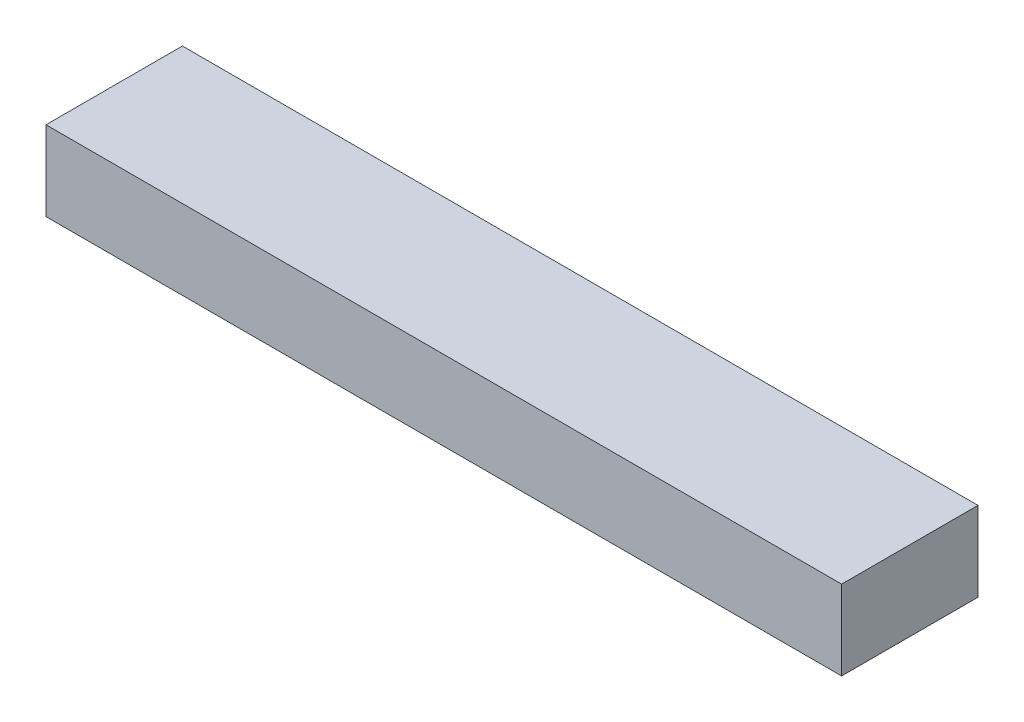
ISO-10303-21;
HEADER;
FILE_DESCRIPTION(('STEP AP214'),'2;1');
FILE_NAME('part.step','',(''),(''),'','','');
FILE_SCHEMA(('AUTOMOTIVE_DESIGN { 1 0 10303 214 1 1 1 1 }'));
ENDSEC;
DATA;
#1=APPLICATION_CONTEXT('core data for automotive mechanical design processes');
#2=APPLICATION_PROTOCOL_DEFINITION('international standard','automotive_design',2000,#1);
#3=PRODUCT_CONTEXT('',#1,'mechanical');
#4=PRODUCT('Part','Part','',(#3));
#5=PRODUCT_RELATED_PRODUCT_CATEGORY('part','',(#4));
#6=PRODUCT_DEFINITION_FORMATION('','',#4);
#7=PRODUCT_DEFINITION_CONTEXT('part definition',#1,'design');
#8=PRODUCT_DEFINITION('design','',#6,#7);
#9=PRODUCT_DEFINITION_SHAPE('','',#8);
#10=(LENGTH_UNIT() NAMED_UNIT(*) SI_UNIT(.MILLI.,.METRE.));
#11=(NAMED_UNIT(*) PLANE_ANGLE_UNIT() SI_UNIT($,.RADIAN.));
#12=(NAMED_UNIT(*) SI_UNIT($,.STERADIAN.) SOLID_ANGLE_UNIT());
#13=UNCERTAINTY_MEASURE_WITH_UNIT(LENGTH_MEASURE(1.E-05),#10,'distance_accuracy_value','');
#14=(GEOMETRIC_REPRESENTATION_CONTEXT(3) GLOBAL_UNCERTAINTY_ASSIGNED_CONTEXT((#13)) GLOBAL_UNIT_ASSIGNED_CONTEXT((#10,
#11,#12)) REPRESENTATION_CONTEXT('',''));
#15=CARTESIAN_POINT('',(0.,0.,0.));
#16=DIRECTION('',(0.,0.,1.));
#17=DIRECTION('',(1.,0.,0.));
#18=AXIS2_PLACEMENT_3D('',#15,#16,#17);
#19=CARTESIAN_POINT('',(0.,70.,0.));
#20=DIRECTION('',(1.,0.,0.));
#21=DIRECTION('',(0.,0.,-1.));
#22=AXIS2_PLACEMENT_3D('',#19,#20,#21);
#23=PLANE('',#22);
#24=DIRECTION('',(0.,0.,1.));
#25=VECTOR('',#24,1.);
#26=CARTESIAN_POINT('',(0.,0.,0.));
#27=LINE('',#26,#25);
#28=CARTESIAN_POINT('',(0.,0.,-120.));
#29=VERTEX_POINT('',#28);
#30=CARTESIAN_POINT('',(0.,0.,0.));
#31=VERTEX_POINT('',#30);
#32=EDGE_CURVE('E94',#29,#31,#27,.T.);
#33=ORIENTED_EDGE('',*,*,#32,.T.);
#34=DIRECTION('',(0.,-1.,0.));
#35=VECTOR('',#34,1.);
#36=CARTESIAN_POINT('',(0.,70.,0.));
#37=LINE('',#36,#35);
#38=CARTESIAN_POINT('',(0.,70.,0.));
#39=VERTEX_POINT('',#38);
#40=EDGE_CURVE('E11',#39,#31,#37,.T.);
#41=ORIENTED_EDGE('',*,*,#40,.F.);
#42=DIRECTION('',(0.,0.,1.));
#43=VECTOR('',#42,1.);
#44=CARTESIAN_POINT('',(0.,70.,0.));
#45=LINE('',#44,#43);
#46=CARTESIAN_POINT('',(0.,70.,-120.));
#47=VERTEX_POINT('',#46);
#48=EDGE_CURVE('E82',#47,#39,#45,.T.);
#49=ORIENTED_EDGE('',*,*,#48,.F.);
#50=DIRECTION('',(0.,-1.,0.));
#51=VECTOR('',#50,1.);
#52=CARTESIAN_POINT('',(0.,70.,-120.));
#53=LINE('',#52,#51);
#54=EDGE_CURVE('E90',#47,#29,#53,.T.);
#55=ORIENTED_EDGE('',*,*,#54,.T.);
#56=EDGE_LOOP('',(#33,#41,#49,#55));
#57=FACE_BOUND('',#56,.T.);
#58=ADVANCED_FACE('F31',(#57),#23,.F.);
#59=CARTESIAN_POINT('',(0.,70.,0.));
#60=DIRECTION('',(0.,0.,-1.));
#61=DIRECTION('',(-1.,0.,0.));
#62=AXIS2_PLACEMENT_3D('',#59,#60,#61);
#63=PLANE('',#62);
#64=DIRECTION('',(1.,0.,0.));
#65=VECTOR('',#64,1.);
#66=CARTESIAN_POINT('',(0.,0.,0.));
#67=LINE('',#66,#65);
#68=CARTESIAN_POINT('',(700.,0.,0.));
#69=VERTEX_POINT('',#68);
#70=EDGE_CURVE('E86',#31,#69,#67,.T.);
#71=ORIENTED_EDGE('',*,*,#70,.T.);
#72=DIRECTION('',(0.,-1.,0.));
#73=VECTOR('',#72,1.);
#74=CARTESIAN_POINT('',(700.,70.,0.));
#75=LINE('',#74,#73);
#76=CARTESIAN_POINT('',(700.,70.,0.));
#77=VERTEX_POINT('',#76);
#78=EDGE_CURVE('E39',#77,#69,#75,.T.);
#79=ORIENTED_EDGE('',*,*,#78,.F.);
#80=DIRECTION('',(1.,0.,0.));
#81=VECTOR('',#80,1.);
#82=CARTESIAN_POINT('',(0.,70.,0.));
#83=LINE('',#82,#81);
#84=EDGE_CURVE('E77',#39,#77,#83,.T.);
#85=ORIENTED_EDGE('',*,*,#84,.F.);
#86=ORIENTED_EDGE('',*,*,#40,.T.);
#87=EDGE_LOOP('',(#71,#79,#85,#86));
#88=FACE_BOUND('',#87,.T.);
#89=ADVANCED_FACE('F85',(#88),#63,.F.);
#90=CARTESIAN_POINT('',(700.,70.,0.));
#91=DIRECTION('',(-1.,0.,0.));
#92=DIRECTION('',(0.,0.,1.));
#93=AXIS2_PLACEMENT_3D('',#90,#91,#92);
#94=PLANE('',#93);
#95=DIRECTION('',(0.,0.,-1.));
#96=VECTOR('',#95,1.);
#97=CARTESIAN_POINT('',(700.,0.,0.));
#98=LINE('',#97,#96);
#99=CARTESIAN_POINT('',(700.,0.,-120.));
#100=VERTEX_POINT('',#99);
#101=EDGE_CURVE('E64',#69,#100,#98,.T.);
#102=ORIENTED_EDGE('',*,*,#101,.T.);
#103=DIRECTION('',(0.,-1.,0.));
#104=VECTOR('',#103,1.);
#105=CARTESIAN_POINT('',(700.,70.,-120.));
#106=LINE('',#105,#104);
#107=CARTESIAN_POINT('',(700.,70.,-120.));
#108=VERTEX_POINT('',#107);
#109=EDGE_CURVE('E87',#108,#100,#106,.T.);
#110=ORIENTED_EDGE('',*,*,#109,.F.);
#111=DIRECTION('',(0.,0.,-1.));
#112=VECTOR('',#111,1.);
#113=CARTESIAN_POINT('',(700.,70.,0.));
#114=LINE('',#113,#112);
#115=EDGE_CURVE('E80',#77,#108,#114,.T.);
#116=ORIENTED_EDGE('',*,*,#115,.F.);
#117=ORIENTED_EDGE('',*,*,#78,.T.);
#118=EDGE_LOOP('',(#102,#110,#116,#117));
#119=FACE_BOUND('',#118,.T.);
#120=ADVANCED_FACE('F88',(#119),#94,.F.);
#121=CARTESIAN_POINT('',(0.,70.,-120.));
#122=DIRECTION('',(0.,0.,1.));
#123=DIRECTION('',(1.,0.,0.));
#124=AXIS2_PLACEMENT_3D('',#121,#122,#123);
#125=PLANE('',#124);
#126=DIRECTION('',(-1.,0.,0.));
#127=VECTOR('',#126,1.);
#128=CARTESIAN_POINT('',(0.,0.,-120.));
#129=LINE('',#128,#127);
#130=EDGE_CURVE('E70',#100,#29,#129,.T.);
#131=ORIENTED_EDGE('',*,*,#130,.T.);
#132=ORIENTED_EDGE('',*,*,#54,.F.);
#133=DIRECTION('',(-1.,0.,0.));
#134=VECTOR('',#133,1.);
#135=CARTESIAN_POINT('',(0.,70.,-120.));
#136=LINE('',#135,#134);
#137=EDGE_CURVE('E47',#108,#47,#136,.T.);
#138=ORIENTED_EDGE('',*,*,#137,.F.);
#139=ORIENTED_EDGE('',*,*,#109,.T.);
#140=EDGE_LOOP('',(#131,#132,#138,#139));
#141=FACE_BOUND('',#140,.T.);
#142=ADVANCED_FACE('F101',(#141),#125,.F.);
#143=CARTESIAN_POINT('',(0.,70.,-120.));
#144=DIRECTION('',(0.,-1.,0.));
#145=DIRECTION('',(0.,0.,-1.));
#146=AXIS2_PLACEMENT_3D('',#143,#144,#145);
#147=PLANE('',#146);
#148=ORIENTED_EDGE('',*,*,#48,.T.);
#149=ORIENTED_EDGE('',*,*,#84,.T.);
#150=ORIENTED_EDGE('',*,*,#115,.T.);
#151=ORIENTED_EDGE('',*,*,#137,.T.);
#152=EDGE_LOOP('',(#148,#149,#150,#151));
#153=FACE_BOUND('',#152,.T.);
#154=ADVANCED_FACE('F78',(#153),#147,.F.);
#155=CARTESIAN_POINT('',(0.,0.,-120.));
#156=DIRECTION('',(0.,-1.,0.));
#157=DIRECTION('',(0.,0.,-1.));
#158=AXIS2_PLACEMENT_3D('',#155,#156,#157);
#159=PLANE('',#158);
#160=ORIENTED_EDGE('',*,*,#32,.F.);
#161=ORIENTED_EDGE('',*,*,#130,.F.);
#162=ORIENTED_EDGE('',*,*,#101,.F.);
#163=ORIENTED_EDGE('',*,*,#70,.F.);
#164=EDGE_LOOP('',(#160,#161,#162,#163));
#165=FACE_BOUND('',#164,.T.);
#166=ADVANCED_FACE('F104',(#165),#159,.T.);
#167=CLOSED_SHELL('',(#58,#89,#120,#142,#154,#166));
#168=MANIFOLD_SOLID_BREP('B2',#167);
#169=ADVANCED_BREP_SHAPE_REPRESENTATION('',(#18,#168),#14);
#170=SHAPE_DEFINITION_REPRESENTATION(#9,#169);
ENDSEC;
END-ISO-10303-21;
